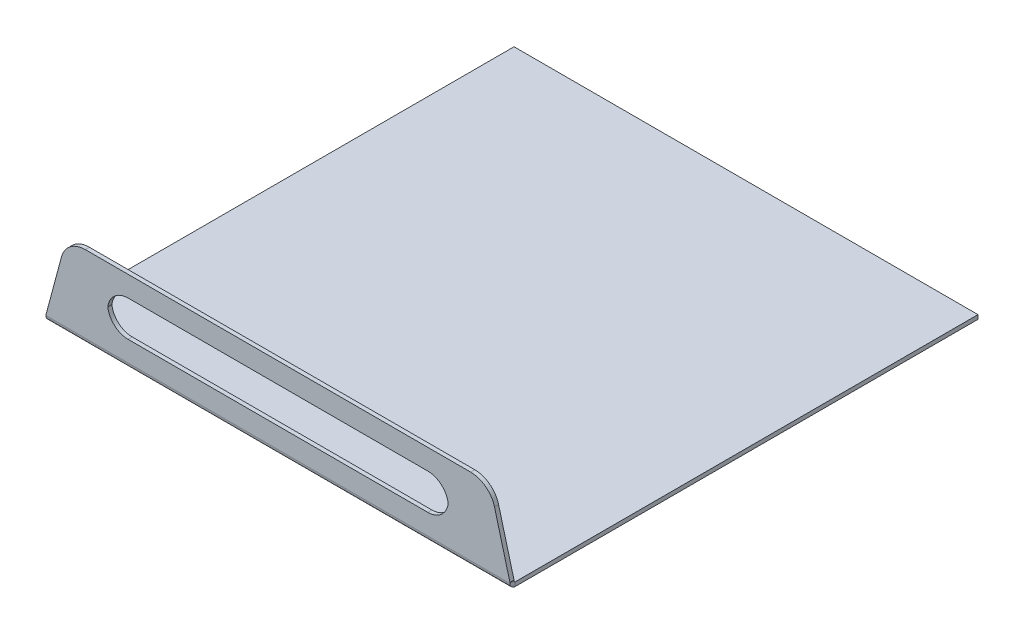
ISO-10303-21;
HEADER;
FILE_DESCRIPTION(('STEP AP214'),'2;1');
FILE_NAME('part.step','',(''),(''),'','','');
FILE_SCHEMA(('AUTOMOTIVE_DESIGN { 1 0 10303 214 1 1 1 1 }'));
ENDSEC;
DATA;
#1=APPLICATION_CONTEXT('core data for automotive mechanical design processes');
#2=APPLICATION_PROTOCOL_DEFINITION('international standard','automotive_design',2000,#1);
#3=PRODUCT_CONTEXT('',#1,'mechanical');
#4=PRODUCT('Part','Part','',(#3));
#5=PRODUCT_RELATED_PRODUCT_CATEGORY('part','',(#4));
#6=PRODUCT_DEFINITION_FORMATION('','',#4);
#7=PRODUCT_DEFINITION_CONTEXT('part definition',#1,'design');
#8=PRODUCT_DEFINITION('design','',#6,#7);
#9=PRODUCT_DEFINITION_SHAPE('','',#8);
#10=(LENGTH_UNIT() NAMED_UNIT(*) SI_UNIT(.MILLI.,.METRE.));
#11=(NAMED_UNIT(*) PLANE_ANGLE_UNIT() SI_UNIT($,.RADIAN.));
#12=(NAMED_UNIT(*) SI_UNIT($,.STERADIAN.) SOLID_ANGLE_UNIT());
#13=UNCERTAINTY_MEASURE_WITH_UNIT(LENGTH_MEASURE(1.E-05),#10,'distance_accuracy_value','');
#14=(GEOMETRIC_REPRESENTATION_CONTEXT(3) GLOBAL_UNCERTAINTY_ASSIGNED_CONTEXT((#13)) GLOBAL_UNIT_ASSIGNED_CONTEXT((#10,
#11,#12)) REPRESENTATION_CONTEXT('',''));
#15=CARTESIAN_POINT('',(0.,0.,0.));
#16=DIRECTION('',(0.,0.,1.));
#17=DIRECTION('',(1.,0.,0.));
#18=AXIS2_PLACEMENT_3D('',#15,#16,#17);
#19=CARTESIAN_POINT('',(143.51,-2.54,143.51));
#20=DIRECTION('',(1.,0.,0.));
#21=DIRECTION('',(0.,0.,-1.));
#22=AXIS2_PLACEMENT_3D('',#19,#20,#21);
#23=PLANE('',#22);
#24=DIRECTION('',(0.,0.,-1.));
#25=VECTOR('',#24,1.);
#26=CARTESIAN_POINT('',(143.51,0.,143.51));
#27=LINE('',#26,#25);
#28=CARTESIAN_POINT('',(143.51,0.,142.7734));
#29=VERTEX_POINT('',#28);
#30=CARTESIAN_POINT('',(143.51,0.,-143.51));
#31=VERTEX_POINT('',#30);
#32=EDGE_CURVE('E224',#29,#31,#27,.T.);
#33=ORIENTED_EDGE('',*,*,#32,.F.);
#34=DIRECTION('',(0.,-1.,0.));
#35=VECTOR('',#34,1.);
#36=CARTESIAN_POINT('',(143.51,0.,142.7734));
#37=LINE('',#36,#35);
#38=CARTESIAN_POINT('',(143.51,-2.54,142.7734));
#39=VERTEX_POINT('',#38);
#40=EDGE_CURVE('E214',#29,#39,#37,.T.);
#41=ORIENTED_EDGE('',*,*,#40,.T.);
#42=DIRECTION('',(0.,0.,-1.));
#43=VECTOR('',#42,1.);
#44=CARTESIAN_POINT('',(143.51,-2.54,143.51));
#45=LINE('',#44,#43);
#46=CARTESIAN_POINT('',(143.51,-2.54,-143.51));
#47=VERTEX_POINT('',#46);
#48=EDGE_CURVE('E226',#39,#47,#45,.T.);
#49=ORIENTED_EDGE('',*,*,#48,.T.);
#50=DIRECTION('',(0.,1.,0.));
#51=VECTOR('',#50,1.);
#52=CARTESIAN_POINT('',(143.51,-2.54,-143.51));
#53=LINE('',#52,#51);
#54=EDGE_CURVE('E235',#47,#31,#53,.T.);
#55=ORIENTED_EDGE('',*,*,#54,.T.);
#56=EDGE_LOOP('',(#33,#41,#49,#55));
#57=FACE_BOUND('',#56,.T.);
#58=ADVANCED_FACE('F38',(#57),#23,.T.);
#59=CARTESIAN_POINT('',(0.,-2.54,0.));
#60=DIRECTION('',(0.,-1.,0.));
#61=DIRECTION('',(0.,0.,-1.));
#62=AXIS2_PLACEMENT_3D('',#59,#60,#61);
#63=PLANE('',#62);
#64=ORIENTED_EDGE('',*,*,#48,.F.);
#65=DIRECTION('',(1.,0.,0.));
#66=VECTOR('',#65,1.);
#67=CARTESIAN_POINT('',(143.51,-2.54,142.7734));
#68=LINE('',#67,#66);
#69=CARTESIAN_POINT('',(-143.51,-2.54,142.7734));
#70=VERTEX_POINT('',#69);
#71=EDGE_CURVE('E170',#39,#70,#68,.F.);
#72=ORIENTED_EDGE('',*,*,#71,.T.);
#73=DIRECTION('',(0.,0.,1.));
#74=VECTOR('',#73,1.);
#75=CARTESIAN_POINT('',(-143.51,-2.54,143.51));
#76=LINE('',#75,#74);
#77=CARTESIAN_POINT('',(-143.51,-2.54,-143.51));
#78=VERTEX_POINT('',#77);
#79=EDGE_CURVE('E232',#78,#70,#76,.T.);
#80=ORIENTED_EDGE('',*,*,#79,.F.);
#81=DIRECTION('',(-1.,0.,0.));
#82=VECTOR('',#81,1.);
#83=CARTESIAN_POINT('',(-143.51,-2.54,-143.51));
#84=LINE('',#83,#82);
#85=EDGE_CURVE('E228',#47,#78,#84,.T.);
#86=ORIENTED_EDGE('',*,*,#85,.F.);
#87=EDGE_LOOP('',(#64,#72,#80,#86));
#88=FACE_BOUND('',#87,.T.);
#89=ADVANCED_FACE('F374',(#88),#63,.T.);
#90=CARTESIAN_POINT('',(0.,0.,0.));
#91=DIRECTION('',(0.,-1.,0.));
#92=DIRECTION('',(0.,0.,-1.));
#93=AXIS2_PLACEMENT_3D('',#90,#91,#92);
#94=PLANE('',#93);
#95=DIRECTION('',(1.,0.,0.));
#96=VECTOR('',#95,1.);
#97=CARTESIAN_POINT('',(143.51,0.,142.7734));
#98=LINE('',#97,#96);
#99=CARTESIAN_POINT('',(-143.51,0.,142.7734));
#100=VERTEX_POINT('',#99);
#101=EDGE_CURVE('E218',#29,#100,#98,.F.);
#102=ORIENTED_EDGE('',*,*,#101,.F.);
#103=ORIENTED_EDGE('',*,*,#32,.T.);
#104=DIRECTION('',(-1.,0.,0.));
#105=VECTOR('',#104,1.);
#106=CARTESIAN_POINT('',(-143.51,0.,-143.51));
#107=LINE('',#106,#105);
#108=CARTESIAN_POINT('',(-143.51,0.,-143.51));
#109=VERTEX_POINT('',#108);
#110=EDGE_CURVE('E237',#31,#109,#107,.T.);
#111=ORIENTED_EDGE('',*,*,#110,.T.);
#112=DIRECTION('',(0.,0.,1.));
#113=VECTOR('',#112,1.);
#114=CARTESIAN_POINT('',(-143.51,0.,143.51));
#115=LINE('',#114,#113);
#116=EDGE_CURVE('E229',#109,#100,#115,.T.);
#117=ORIENTED_EDGE('',*,*,#116,.T.);
#118=EDGE_LOOP('',(#102,#103,#111,#117));
#119=FACE_BOUND('',#118,.T.);
#120=ADVANCED_FACE('F380',(#119),#94,.F.);
#121=CARTESIAN_POINT('',(-143.51,-2.54,143.51));
#122=DIRECTION('',(-1.,0.,0.));
#123=DIRECTION('',(0.,0.,1.));
#124=AXIS2_PLACEMENT_3D('',#121,#122,#123);
#125=PLANE('',#124);
#126=DIRECTION('',(0.,-1.,0.));
#127=VECTOR('',#126,1.);
#128=CARTESIAN_POINT('',(-143.51,0.,142.7734));
#129=LINE('',#128,#127);
#130=EDGE_CURVE('E221',#100,#70,#129,.T.);
#131=ORIENTED_EDGE('',*,*,#130,.F.);
#132=ORIENTED_EDGE('',*,*,#116,.F.);
#133=DIRECTION('',(0.,1.,0.));
#134=VECTOR('',#133,1.);
#135=CARTESIAN_POINT('',(-143.51,-2.54,-143.51));
#136=LINE('',#135,#134);
#137=EDGE_CURVE('E242',#78,#109,#136,.T.);
#138=ORIENTED_EDGE('',*,*,#137,.F.);
#139=ORIENTED_EDGE('',*,*,#79,.T.);
#140=EDGE_LOOP('',(#131,#132,#138,#139));
#141=FACE_BOUND('',#140,.T.);
#142=ADVANCED_FACE('F537',(#141),#125,.T.);
#143=CARTESIAN_POINT('',(-143.51,-2.54,-143.51));
#144=DIRECTION('',(0.,0.,-1.));
#145=DIRECTION('',(-1.,0.,0.));
#146=AXIS2_PLACEMENT_3D('',#143,#144,#145);
#147=PLANE('',#146);
#148=ORIENTED_EDGE('',*,*,#110,.F.);
#149=ORIENTED_EDGE('',*,*,#54,.F.);
#150=ORIENTED_EDGE('',*,*,#85,.T.);
#151=ORIENTED_EDGE('',*,*,#137,.T.);
#152=EDGE_LOOP('',(#148,#149,#150,#151));
#153=FACE_BOUND('',#152,.T.);
#154=ADVANCED_FACE('F386',(#153),#147,.T.);
#155=CARTESIAN_POINT('',(-143.51,0.736600000000004,142.7734));
#156=DIRECTION('',(-1.,0.,0.));
#157=DIRECTION('',(0.,0.,1.));
#158=AXIS2_PLACEMENT_3D('',#155,#156,#157);
#159=PLANE('',#158);
#160=DIRECTION('',(0.,0.,1.));
#161=VECTOR('',#160,1.);
#162=CARTESIAN_POINT('',(-143.51,0.736600000000004,143.51));
#163=LINE('',#162,#161);
#164=CARTESIAN_POINT('',(-143.51,0.736600000000004,143.51));
#165=VERTEX_POINT('',#164);
#166=CARTESIAN_POINT('',(-143.51,0.736600000000004,146.05));
#167=VERTEX_POINT('',#166);
#168=EDGE_CURVE('E320',#165,#167,#163,.T.);
#169=ORIENTED_EDGE('',*,*,#168,.F.);
#170=CARTESIAN_POINT('',(-143.51,0.736600000000004,142.7734));
#171=DIRECTION('',(1.,0.,0.));
#172=DIRECTION('',(0.,0.,-1.));
#173=AXIS2_PLACEMENT_3D('',#170,#171,#172);
#174=CIRCLE('',#173,0.736600000000004);
#175=EDGE_CURVE('E173',#100,#165,#174,.F.);
#176=ORIENTED_EDGE('',*,*,#175,.F.);
#177=ORIENTED_EDGE('',*,*,#130,.T.);
#178=CARTESIAN_POINT('',(-143.51,0.736600000000004,142.7734));
#179=DIRECTION('',(1.,0.,0.));
#180=DIRECTION('',(0.,0.,-1.));
#181=AXIS2_PLACEMENT_3D('',#178,#179,#180);
#182=CIRCLE('',#181,3.2766);
#183=EDGE_CURVE('E213',#70,#167,#182,.F.);
#184=ORIENTED_EDGE('',*,*,#183,.T.);
#185=EDGE_LOOP('',(#169,#176,#177,#184));
#186=FACE_BOUND('',#185,.T.);
#187=ADVANCED_FACE('F519',(#186),#159,.T.);
#188=CARTESIAN_POINT('',(143.51,0.736600000000004,142.7734));
#189=DIRECTION('',(-1.,0.,0.));
#190=DIRECTION('',(0.,0.,1.));
#191=AXIS2_PLACEMENT_3D('',#188,#189,#190);
#192=PLANE('',#191);
#193=CARTESIAN_POINT('',(143.51,0.736600000000004,142.7734));
#194=DIRECTION('',(1.,0.,0.));
#195=DIRECTION('',(0.,0.,-1.));
#196=AXIS2_PLACEMENT_3D('',#193,#194,#195);
#197=CIRCLE('',#196,0.736600000000004);
#198=CARTESIAN_POINT('',(143.51,0.736600000000004,143.51));
#199=VERTEX_POINT('',#198);
#200=EDGE_CURVE('E180',#199,#29,#197,.T.);
#201=ORIENTED_EDGE('',*,*,#200,.F.);
#202=DIRECTION('',(0.,0.,1.));
#203=VECTOR('',#202,1.);
#204=CARTESIAN_POINT('',(143.51,0.736600000000004,143.51));
#205=LINE('',#204,#203);
#206=CARTESIAN_POINT('',(143.51,0.736600000000004,146.05));
#207=VERTEX_POINT('',#206);
#208=EDGE_CURVE('E177',#199,#207,#205,.T.);
#209=ORIENTED_EDGE('',*,*,#208,.T.);
#210=CARTESIAN_POINT('',(143.51,0.736600000000004,142.7734));
#211=DIRECTION('',(1.,0.,0.));
#212=DIRECTION('',(0.,0.,-1.));
#213=AXIS2_PLACEMENT_3D('',#210,#211,#212);
#214=CIRCLE('',#213,3.2766);
#215=EDGE_CURVE('E163',#207,#39,#214,.T.);
#216=ORIENTED_EDGE('',*,*,#215,.T.);
#217=ORIENTED_EDGE('',*,*,#40,.F.);
#218=EDGE_LOOP('',(#201,#209,#216,#217));
#219=FACE_BOUND('',#218,.T.);
#220=ADVANCED_FACE('F178',(#219),#192,.F.);
#221=CARTESIAN_POINT('',(143.51,0.736600000000004,142.7734));
#222=DIRECTION('',(1.,0.,0.));
#223=DIRECTION('',(0.,0.,1.));
#224=AXIS2_PLACEMENT_3D('',#221,#222,#223);
#225=CYLINDRICAL_SURFACE('',#224,3.2766);
#226=ORIENTED_EDGE('',*,*,#71,.F.);
#227=ORIENTED_EDGE('',*,*,#215,.F.);
#228=DIRECTION('',(-1.,0.,0.));
#229=VECTOR('',#228,1.);
#230=CARTESIAN_POINT('',(0.,0.736600000000004,146.05));
#231=LINE('',#230,#229);
#232=EDGE_CURVE('E167',#207,#167,#231,.T.);
#233=ORIENTED_EDGE('',*,*,#232,.T.);
#234=ORIENTED_EDGE('',*,*,#183,.F.);
#235=EDGE_LOOP('',(#226,#227,#233,#234));
#236=FACE_BOUND('',#235,.T.);
#237=ADVANCED_FACE('F165',(#236),#225,.T.);
#238=CARTESIAN_POINT('',(143.51,0.736600000000004,142.7734));
#239=DIRECTION('',(1.,0.,0.));
#240=DIRECTION('',(0.,0.,1.));
#241=AXIS2_PLACEMENT_3D('',#238,#239,#240);
#242=CYLINDRICAL_SURFACE('',#241,0.736600000000004);
#243=ORIENTED_EDGE('',*,*,#101,.T.);
#244=ORIENTED_EDGE('',*,*,#175,.T.);
#245=DIRECTION('',(1.,0.,0.));
#246=VECTOR('',#245,1.);
#247=CARTESIAN_POINT('',(-143.51,0.736600000000004,143.51));
#248=LINE('',#247,#246);
#249=EDGE_CURVE('E185',#165,#199,#248,.T.);
#250=ORIENTED_EDGE('',*,*,#249,.T.);
#251=ORIENTED_EDGE('',*,*,#200,.T.);
#252=EDGE_LOOP('',(#243,#244,#250,#251));
#253=FACE_BOUND('',#252,.T.);
#254=ADVANCED_FACE('F491',(#253),#242,.F.);
#255=CARTESIAN_POINT('',(-143.51,0.,146.05));
#256=DIRECTION('',(1.,0.,0.));
#257=DIRECTION('',(0.,0.,-1.));
#258=AXIS2_PLACEMENT_3D('',#255,#256,#257);
#259=PLANE('',#258);
#260=DIRECTION('',(0.,-1.,0.));
#261=VECTOR('',#260,1.);
#262=CARTESIAN_POINT('',(-143.51,0.,146.05));
#263=LINE('',#262,#261);
#264=CARTESIAN_POINT('',(-143.51,1.26999999999941,146.05));
#265=VERTEX_POINT('',#264);
#266=EDGE_CURVE('E195',#265,#167,#263,.T.);
#267=ORIENTED_EDGE('',*,*,#266,.F.);
#268=DIRECTION('',(0.,0.,-1.));
#269=VECTOR('',#268,1.);
#270=CARTESIAN_POINT('',(-143.51,1.26999999999942,146.05));
#271=LINE('',#270,#269);
#272=CARTESIAN_POINT('',(-143.51,1.26999999999928,143.51));
#273=VERTEX_POINT('',#272);
#274=EDGE_CURVE('E255',#265,#273,#271,.T.);
#275=ORIENTED_EDGE('',*,*,#274,.T.);
#276=DIRECTION('',(0.,-1.,0.));
#277=VECTOR('',#276,1.);
#278=CARTESIAN_POINT('',(-143.51,0.,143.51));
#279=LINE('',#278,#277);
#280=EDGE_CURVE('E196',#273,#165,#279,.T.);
#281=ORIENTED_EDGE('',*,*,#280,.T.);
#282=ORIENTED_EDGE('',*,*,#168,.T.);
#283=EDGE_LOOP('',(#267,#275,#281,#282));
#284=FACE_BOUND('',#283,.T.);
#285=ADVANCED_FACE('F315',(#284),#259,.F.);
#286=CARTESIAN_POINT('',(143.51,48.26,146.05));
#287=DIRECTION('',(-1.,0.,0.));
#288=DIRECTION('',(0.,0.,1.));
#289=AXIS2_PLACEMENT_3D('',#286,#287,#288);
#290=PLANE('',#289);
#291=DIRECTION('',(0.,1.,0.));
#292=VECTOR('',#291,1.);
#293=CARTESIAN_POINT('',(143.51,48.26,143.51));
#294=LINE('',#293,#292);
#295=CARTESIAN_POINT('',(143.51,1.26999999999941,143.51));
#296=VERTEX_POINT('',#295);
#297=EDGE_CURVE('E208',#199,#296,#294,.T.);
#298=ORIENTED_EDGE('',*,*,#297,.T.);
#299=DIRECTION('',(0.,0.,1.));
#300=VECTOR('',#299,1.);
#301=CARTESIAN_POINT('',(143.51,1.26999999999941,146.05));
#302=LINE('',#301,#300);
#303=CARTESIAN_POINT('',(143.51,1.2699999999994,146.05));
#304=VERTEX_POINT('',#303);
#305=EDGE_CURVE('E200',#296,#304,#302,.T.);
#306=ORIENTED_EDGE('',*,*,#305,.T.);
#307=DIRECTION('',(0.,1.,0.));
#308=VECTOR('',#307,1.);
#309=CARTESIAN_POINT('',(143.51,48.26,146.05));
#310=LINE('',#309,#308);
#311=EDGE_CURVE('E192',#207,#304,#310,.T.);
#312=ORIENTED_EDGE('',*,*,#311,.F.);
#313=ORIENTED_EDGE('',*,*,#208,.F.);
#314=EDGE_LOOP('',(#298,#306,#312,#313));
#315=FACE_BOUND('',#314,.T.);
#316=ADVANCED_FACE('F198',(#315),#290,.F.);
#317=CARTESIAN_POINT('',(0.,0.,146.05));
#318=DIRECTION('',(0.,0.,-1.));
#319=DIRECTION('',(-1.,0.,0.));
#320=AXIS2_PLACEMENT_3D('',#317,#318,#319);
#321=PLANE('',#320);
#322=CARTESIAN_POINT('',(-92.71,26.1366,146.05));
#323=DIRECTION('',(0.,0.,-1.));
#324=DIRECTION('',(-1.,0.,0.));
#325=AXIS2_PLACEMENT_3D('',#322,#323,#324);
#326=CIRCLE('',#325,12.7);
#327=CARTESIAN_POINT('',(-92.71,13.4366,146.05));
#328=VERTEX_POINT('',#327);
#329=CARTESIAN_POINT('',(-105.303886338617,24.4983,146.05));
#330=VERTEX_POINT('',#329);
#331=EDGE_CURVE('E276',#328,#330,#326,.T.);
#332=ORIENTED_EDGE('',*,*,#331,.T.);
#333=CARTESIAN_POINT('',(-92.71,22.86,146.05));
#334=DIRECTION('',(0.,0.,-1.));
#335=DIRECTION('',(-1.,0.,0.));
#336=AXIS2_PLACEMENT_3D('',#333,#334,#335);
#337=CIRCLE('',#336,12.7);
#338=CARTESIAN_POINT('',(-92.71,35.56,146.05));
#339=VERTEX_POINT('',#338);
#340=EDGE_CURVE('E280',#330,#339,#337,.T.);
#341=ORIENTED_EDGE('',*,*,#340,.T.);
#342=DIRECTION('',(-1.,0.,0.));
#343=VECTOR('',#342,1.);
#344=CARTESIAN_POINT('',(-105.41,35.56,146.05));
#345=LINE('',#344,#343);
#346=CARTESIAN_POINT('',(92.71,35.56,146.05));
#347=VERTEX_POINT('',#346);
#348=EDGE_CURVE('E325',#347,#339,#345,.T.);
#349=ORIENTED_EDGE('',*,*,#348,.F.);
#350=CARTESIAN_POINT('',(92.71,22.86,146.05));
#351=DIRECTION('',(0.,0.,-1.));
#352=DIRECTION('',(-1.,0.,0.));
#353=AXIS2_PLACEMENT_3D('',#350,#351,#352);
#354=CIRCLE('',#353,12.7);
#355=CARTESIAN_POINT('',(105.303886338617,24.4983,146.05));
#356=VERTEX_POINT('',#355);
#357=EDGE_CURVE('E272',#347,#356,#354,.T.);
#358=ORIENTED_EDGE('',*,*,#357,.T.);
#359=CARTESIAN_POINT('',(92.71,26.1366,146.05));
#360=DIRECTION('',(0.,0.,-1.));
#361=DIRECTION('',(-1.,0.,0.));
#362=AXIS2_PLACEMENT_3D('',#359,#360,#361);
#363=CIRCLE('',#362,12.7);
#364=CARTESIAN_POINT('',(92.71,13.4366,146.05));
#365=VERTEX_POINT('',#364);
#366=EDGE_CURVE('E268',#356,#365,#363,.T.);
#367=ORIENTED_EDGE('',*,*,#366,.T.);
#368=DIRECTION('',(1.,0.,0.));
#369=VECTOR('',#368,1.);
#370=CARTESIAN_POINT('',(-105.41,13.4366,146.05));
#371=LINE('',#370,#369);
#372=EDGE_CURVE('E288',#328,#365,#371,.T.);
#373=ORIENTED_EDGE('',*,*,#372,.F.);
#374=EDGE_LOOP('',(#332,#341,#349,#358,#367,#373));
#375=FACE_BOUND('',#374,.T.);
#376=DIRECTION('',(-1.,0.,0.));
#377=VECTOR('',#376,1.);
#378=CARTESIAN_POINT('',(-143.51,48.26,146.05));
#379=LINE('',#378,#377);
#380=CARTESIAN_POINT('',(119.225004150862,48.26,146.05));
#381=VERTEX_POINT('',#380);
#382=CARTESIAN_POINT('',(-119.225004150862,48.26,146.05));
#383=VERTEX_POINT('',#382);
#384=EDGE_CURVE('E201',#381,#383,#379,.T.);
#385=ORIENTED_EDGE('',*,*,#384,.T.);
#386=CARTESIAN_POINT('',(-119.225004150862,33.02,146.05));
#387=DIRECTION('',(0.,0.,-1.));
#388=DIRECTION('',(-1.,0.,0.));
#389=AXIS2_PLACEMENT_3D('',#386,#387,#388);
#390=CIRCLE('',#389,15.24);
#391=CARTESIAN_POINT('',(-133.945713743508,36.9644022473624,146.05));
#392=VERTEX_POINT('',#391);
#393=EDGE_CURVE('E299',#383,#392,#390,.F.);
#394=ORIENTED_EDGE('',*,*,#393,.T.);
#395=DIRECTION('',(0.258819045102518,0.965925826289069,0.));
#396=VECTOR('',#395,1.);
#397=CARTESIAN_POINT('',(-143.51,1.26999999999942,146.05));
#398=LINE('',#397,#396);
#399=EDGE_CURVE('E251',#392,#265,#398,.F.);
#400=ORIENTED_EDGE('',*,*,#399,.T.);
#401=ORIENTED_EDGE('',*,*,#266,.T.);
#402=ORIENTED_EDGE('',*,*,#232,.F.);
#403=ORIENTED_EDGE('',*,*,#311,.T.);
#404=DIRECTION('',(0.258819045102519,-0.965925826289069,0.));
#405=VECTOR('',#404,1.);
#406=CARTESIAN_POINT('',(130.919067447661,48.26,146.05));
#407=LINE('',#406,#405);
#408=CARTESIAN_POINT('',(133.945713743508,36.9644022473624,146.05));
#409=VERTEX_POINT('',#408);
#410=EDGE_CURVE('E253',#304,#409,#407,.F.);
#411=ORIENTED_EDGE('',*,*,#410,.T.);
#412=CARTESIAN_POINT('',(119.225004150862,33.02,146.05));
#413=DIRECTION('',(0.,0.,-1.));
#414=DIRECTION('',(-1.,0.,0.));
#415=AXIS2_PLACEMENT_3D('',#412,#413,#414);
#416=CIRCLE('',#415,15.24);
#417=EDGE_CURVE('E297',#409,#381,#416,.F.);
#418=ORIENTED_EDGE('',*,*,#417,.T.);
#419=EDGE_LOOP('',(#385,#394,#400,#401,#402,#403,#411,#418));
#420=FACE_BOUND('',#419,.T.);
#421=ADVANCED_FACE('F190',(#375,#420),#321,.F.);
#422=CARTESIAN_POINT('',(0.,0.,143.51));
#423=DIRECTION('',(0.,0.,-1.));
#424=DIRECTION('',(-1.,0.,0.));
#425=AXIS2_PLACEMENT_3D('',#422,#423,#424);
#426=PLANE('',#425);
#427=DIRECTION('',(-1.,0.,0.));
#428=VECTOR('',#427,1.);
#429=CARTESIAN_POINT('',(-105.41,35.56,143.51));
#430=LINE('',#429,#428);
#431=CARTESIAN_POINT('',(92.71,35.56,143.51));
#432=VERTEX_POINT('',#431);
#433=CARTESIAN_POINT('',(-92.71,35.56,143.51));
#434=VERTEX_POINT('',#433);
#435=EDGE_CURVE('E322',#432,#434,#430,.T.);
#436=ORIENTED_EDGE('',*,*,#435,.T.);
#437=CARTESIAN_POINT('',(-92.71,22.86,143.51));
#438=DIRECTION('',(0.,0.,-1.));
#439=DIRECTION('',(-1.,0.,0.));
#440=AXIS2_PLACEMENT_3D('',#437,#438,#439);
#441=CIRCLE('',#440,12.7);
#442=CARTESIAN_POINT('',(-105.303886338617,24.4983,143.51));
#443=VERTEX_POINT('',#442);
#444=EDGE_CURVE('E282',#434,#443,#441,.F.);
#445=ORIENTED_EDGE('',*,*,#444,.T.);
#446=CARTESIAN_POINT('',(-92.71,26.1366,143.51));
#447=DIRECTION('',(0.,0.,-1.));
#448=DIRECTION('',(-1.,0.,0.));
#449=AXIS2_PLACEMENT_3D('',#446,#447,#448);
#450=CIRCLE('',#449,12.7);
#451=CARTESIAN_POINT('',(-92.71,13.4366,143.51));
#452=VERTEX_POINT('',#451);
#453=EDGE_CURVE('E278',#443,#452,#450,.F.);
#454=ORIENTED_EDGE('',*,*,#453,.T.);
#455=DIRECTION('',(1.,0.,0.));
#456=VECTOR('',#455,1.);
#457=CARTESIAN_POINT('',(-105.41,13.4366,143.51));
#458=LINE('',#457,#456);
#459=CARTESIAN_POINT('',(92.71,13.4366,143.51));
#460=VERTEX_POINT('',#459);
#461=EDGE_CURVE('E328',#452,#460,#458,.T.);
#462=ORIENTED_EDGE('',*,*,#461,.T.);
#463=CARTESIAN_POINT('',(92.71,26.1366,143.51));
#464=DIRECTION('',(0.,0.,-1.));
#465=DIRECTION('',(-1.,0.,0.));
#466=AXIS2_PLACEMENT_3D('',#463,#464,#465);
#467=CIRCLE('',#466,12.7);
#468=CARTESIAN_POINT('',(105.303886338617,24.4983,143.51));
#469=VERTEX_POINT('',#468);
#470=EDGE_CURVE('E270',#460,#469,#467,.F.);
#471=ORIENTED_EDGE('',*,*,#470,.T.);
#472=CARTESIAN_POINT('',(92.71,22.86,143.51));
#473=DIRECTION('',(0.,0.,-1.));
#474=DIRECTION('',(-1.,0.,0.));
#475=AXIS2_PLACEMENT_3D('',#472,#473,#474);
#476=CIRCLE('',#475,12.7);
#477=EDGE_CURVE('E274',#469,#432,#476,.F.);
#478=ORIENTED_EDGE('',*,*,#477,.T.);
#479=EDGE_LOOP('',(#436,#445,#454,#462,#471,#478));
#480=FACE_BOUND('',#479,.T.);
#481=DIRECTION('',(-0.258819045102518,-0.965925826289069,0.));
#482=VECTOR('',#481,1.);
#483=CARTESIAN_POINT('',(-134.214152848552,35.9625738685965,143.51));
#484=LINE('',#483,#482);
#485=CARTESIAN_POINT('',(-133.945713743508,36.9644022473624,143.51));
#486=VERTEX_POINT('',#485);
#487=EDGE_CURVE('E244',#273,#486,#484,.F.);
#488=ORIENTED_EDGE('',*,*,#487,.T.);
#489=CARTESIAN_POINT('',(-119.225004150862,33.02,143.51));
#490=DIRECTION('',(0.,0.,-1.));
#491=DIRECTION('',(-1.,0.,0.));
#492=AXIS2_PLACEMENT_3D('',#489,#490,#491);
#493=CIRCLE('',#492,15.24);
#494=CARTESIAN_POINT('',(-119.225004150862,48.26,143.51));
#495=VERTEX_POINT('',#494);
#496=EDGE_CURVE('E46',#486,#495,#493,.T.);
#497=ORIENTED_EDGE('',*,*,#496,.T.);
#498=DIRECTION('',(-1.,0.,0.));
#499=VECTOR('',#498,1.);
#500=CARTESIAN_POINT('',(-143.51,48.26,143.51));
#501=LINE('',#500,#499);
#502=CARTESIAN_POINT('',(119.225004150862,48.26,143.51));
#503=VERTEX_POINT('',#502);
#504=EDGE_CURVE('E204',#503,#495,#501,.T.);
#505=ORIENTED_EDGE('',*,*,#504,.F.);
#506=CARTESIAN_POINT('',(119.225004150862,33.02,143.51));
#507=DIRECTION('',(0.,0.,-1.));
#508=DIRECTION('',(-1.,0.,0.));
#509=AXIS2_PLACEMENT_3D('',#506,#507,#508);
#510=CIRCLE('',#509,15.24);
#511=CARTESIAN_POINT('',(133.945713743508,36.9644022473624,143.51));
#512=VERTEX_POINT('',#511);
#513=EDGE_CURVE('E53',#503,#512,#510,.T.);
#514=ORIENTED_EDGE('',*,*,#513,.T.);
#515=DIRECTION('',(-0.258819045102519,0.965925826289069,0.));
#516=VECTOR('',#515,1.);
#517=CARTESIAN_POINT('',(134.214152848552,35.9625738685966,143.51));
#518=LINE('',#517,#516);
#519=EDGE_CURVE('E248',#512,#296,#518,.F.);
#520=ORIENTED_EDGE('',*,*,#519,.T.);
#521=ORIENTED_EDGE('',*,*,#297,.F.);
#522=ORIENTED_EDGE('',*,*,#249,.F.);
#523=ORIENTED_EDGE('',*,*,#280,.F.);
#524=EDGE_LOOP('',(#488,#497,#505,#514,#520,#521,#522,#523));
#525=FACE_BOUND('',#524,.T.);
#526=ADVANCED_FACE('F303',(#480,#525),#426,.T.);
#527=CARTESIAN_POINT('',(-143.51,48.26,146.05));
#528=DIRECTION('',(0.,-1.,0.));
#529=DIRECTION('',(0.,0.,-1.));
#530=AXIS2_PLACEMENT_3D('',#527,#528,#529);
#531=PLANE('',#530);
#532=ORIENTED_EDGE('',*,*,#504,.T.);
#533=DIRECTION('',(0.,0.,-1.));
#534=VECTOR('',#533,1.);
#535=CARTESIAN_POINT('',(-119.225004150862,48.26,146.05));
#536=LINE('',#535,#534);
#537=EDGE_CURVE('E294',#495,#383,#536,.F.);
#538=ORIENTED_EDGE('',*,*,#537,.T.);
#539=ORIENTED_EDGE('',*,*,#384,.F.);
#540=DIRECTION('',(0.,0.,1.));
#541=VECTOR('',#540,1.);
#542=CARTESIAN_POINT('',(119.225004150862,48.26,143.51));
#543=LINE('',#542,#541);
#544=EDGE_CURVE('E284',#381,#503,#543,.F.);
#545=ORIENTED_EDGE('',*,*,#544,.T.);
#546=EDGE_LOOP('',(#532,#538,#539,#545));
#547=FACE_BOUND('',#546,.T.);
#548=ADVANCED_FACE('F308',(#547),#531,.F.);
#549=CARTESIAN_POINT('',(-105.41,35.56,143.51));
#550=DIRECTION('',(0.,1.,0.));
#551=DIRECTION('',(0.,0.,1.));
#552=AXIS2_PLACEMENT_3D('',#549,#550,#551);
#553=PLANE('',#552);
#554=ORIENTED_EDGE('',*,*,#435,.F.);
#555=DIRECTION('',(0.,0.,1.));
#556=VECTOR('',#555,1.);
#557=CARTESIAN_POINT('',(92.71,35.56,146.05));
#558=LINE('',#557,#556);
#559=EDGE_CURVE('E266',#432,#347,#558,.T.);
#560=ORIENTED_EDGE('',*,*,#559,.T.);
#561=ORIENTED_EDGE('',*,*,#348,.T.);
#562=DIRECTION('',(0.,0.,1.));
#563=VECTOR('',#562,1.);
#564=CARTESIAN_POINT('',(-92.71,35.56,143.51));
#565=LINE('',#564,#563);
#566=EDGE_CURVE('E264',#339,#434,#565,.F.);
#567=ORIENTED_EDGE('',*,*,#566,.T.);
#568=EDGE_LOOP('',(#554,#560,#561,#567));
#569=FACE_BOUND('',#568,.T.);
#570=ADVANCED_FACE('F355',(#569),#553,.F.);
#571=CARTESIAN_POINT('',(-105.41,13.4366,143.51));
#572=DIRECTION('',(0.,-1.,0.));
#573=DIRECTION('',(0.,0.,-1.));
#574=AXIS2_PLACEMENT_3D('',#571,#572,#573);
#575=PLANE('',#574);
#576=ORIENTED_EDGE('',*,*,#372,.T.);
#577=DIRECTION('',(0.,0.,1.));
#578=VECTOR('',#577,1.);
#579=CARTESIAN_POINT('',(92.71,13.4366,143.51));
#580=LINE('',#579,#578);
#581=EDGE_CURVE('E261',#365,#460,#580,.F.);
#582=ORIENTED_EDGE('',*,*,#581,.T.);
#583=ORIENTED_EDGE('',*,*,#461,.F.);
#584=DIRECTION('',(0.,0.,1.));
#585=VECTOR('',#584,1.);
#586=CARTESIAN_POINT('',(-92.71,13.4366,146.05));
#587=LINE('',#586,#585);
#588=EDGE_CURVE('E258',#452,#328,#587,.T.);
#589=ORIENTED_EDGE('',*,*,#588,.T.);
#590=EDGE_LOOP('',(#576,#582,#583,#589));
#591=FACE_BOUND('',#590,.T.);
#592=ADVANCED_FACE('F340',(#591),#575,.F.);
#593=CARTESIAN_POINT('',(130.919067447661,48.26,146.05));
#594=DIRECTION('',(-0.965925826289069,-0.258819045102519,0.));
#595=DIRECTION('',(0.,0.,-1.));
#596=AXIS2_PLACEMENT_3D('',#593,#594,#595);
#597=PLANE('',#596);
#598=ORIENTED_EDGE('',*,*,#519,.F.);
#599=DIRECTION('',(0.,0.,-1.));
#600=VECTOR('',#599,1.);
#601=CARTESIAN_POINT('',(133.945713743508,36.9644022473624,146.05));
#602=LINE('',#601,#600);
#603=EDGE_CURVE('E11',#512,#409,#602,.F.);
#604=ORIENTED_EDGE('',*,*,#603,.T.);
#605=ORIENTED_EDGE('',*,*,#410,.F.);
#606=ORIENTED_EDGE('',*,*,#305,.F.);
#607=EDGE_LOOP('',(#598,#604,#605,#606));
#608=FACE_BOUND('',#607,.T.);
#609=ADVANCED_FACE('F388',(#608),#597,.F.);
#610=CARTESIAN_POINT('',(-143.51,1.26999999999942,146.05));
#611=DIRECTION('',(0.965925826289069,-0.258819045102518,0.));
#612=DIRECTION('',(0.,0.,-1.));
#613=AXIS2_PLACEMENT_3D('',#610,#611,#612);
#614=PLANE('',#613);
#615=ORIENTED_EDGE('',*,*,#399,.F.);
#616=DIRECTION('',(0.,0.,1.));
#617=VECTOR('',#616,1.);
#618=CARTESIAN_POINT('',(-133.945713743508,36.9644022473624,143.51));
#619=LINE('',#618,#617);
#620=EDGE_CURVE('E61',#392,#486,#619,.F.);
#621=ORIENTED_EDGE('',*,*,#620,.T.);
#622=ORIENTED_EDGE('',*,*,#487,.F.);
#623=ORIENTED_EDGE('',*,*,#274,.F.);
#624=EDGE_LOOP('',(#615,#621,#622,#623));
#625=FACE_BOUND('',#624,.T.);
#626=ADVANCED_FACE('F313',(#625),#614,.F.);
#627=CARTESIAN_POINT('',(92.71,22.86,143.51));
#628=DIRECTION('',(0.,0.,-1.));
#629=DIRECTION('',(-1.,0.,0.));
#630=AXIS2_PLACEMENT_3D('',#627,#628,#629);
#631=CYLINDRICAL_SURFACE('',#630,12.7);
#632=ORIENTED_EDGE('',*,*,#559,.F.);
#633=ORIENTED_EDGE('',*,*,#477,.F.);
#634=DIRECTION('',(0.,0.,-1.));
#635=VECTOR('',#634,1.);
#636=CARTESIAN_POINT('',(105.303886338617,24.4983,144.78));
#637=LINE('',#636,#635);
#638=EDGE_CURVE('E285',#356,#469,#637,.T.);
#639=ORIENTED_EDGE('',*,*,#638,.F.);
#640=ORIENTED_EDGE('',*,*,#357,.F.);
#641=EDGE_LOOP('',(#632,#633,#639,#640));
#642=FACE_BOUND('',#641,.T.);
#643=ADVANCED_FACE('F359',(#642),#631,.F.);
#644=CARTESIAN_POINT('',(92.71,26.1366,143.51));
#645=DIRECTION('',(0.,0.,-1.));
#646=DIRECTION('',(-1.,0.,0.));
#647=AXIS2_PLACEMENT_3D('',#644,#645,#646);
#648=CYLINDRICAL_SURFACE('',#647,12.7);
#649=ORIENTED_EDGE('',*,*,#470,.F.);
#650=ORIENTED_EDGE('',*,*,#581,.F.);
#651=ORIENTED_EDGE('',*,*,#366,.F.);
#652=ORIENTED_EDGE('',*,*,#638,.T.);
#653=EDGE_LOOP('',(#649,#650,#651,#652));
#654=FACE_BOUND('',#653,.T.);
#655=ADVANCED_FACE('F363',(#654),#648,.F.);
#656=CARTESIAN_POINT('',(-92.71,22.86,143.51));
#657=DIRECTION('',(0.,0.,-1.));
#658=DIRECTION('',(-1.,0.,0.));
#659=AXIS2_PLACEMENT_3D('',#656,#657,#658);
#660=CYLINDRICAL_SURFACE('',#659,12.7);
#661=DIRECTION('',(0.,0.,-1.));
#662=VECTOR('',#661,1.);
#663=CARTESIAN_POINT('',(-105.303886338617,24.4983,144.78));
#664=LINE('',#663,#662);
#665=EDGE_CURVE('E289',#443,#330,#664,.F.);
#666=ORIENTED_EDGE('',*,*,#665,.F.);
#667=ORIENTED_EDGE('',*,*,#444,.F.);
#668=ORIENTED_EDGE('',*,*,#566,.F.);
#669=ORIENTED_EDGE('',*,*,#340,.F.);
#670=EDGE_LOOP('',(#666,#667,#668,#669));
#671=FACE_BOUND('',#670,.T.);
#672=ADVANCED_FACE('F351',(#671),#660,.F.);
#673=CARTESIAN_POINT('',(-92.71,26.1366,143.51));
#674=DIRECTION('',(0.,0.,-1.));
#675=DIRECTION('',(-1.,0.,0.));
#676=AXIS2_PLACEMENT_3D('',#673,#674,#675);
#677=CYLINDRICAL_SURFACE('',#676,12.7);
#678=ORIENTED_EDGE('',*,*,#453,.F.);
#679=ORIENTED_EDGE('',*,*,#665,.T.);
#680=ORIENTED_EDGE('',*,*,#331,.F.);
#681=ORIENTED_EDGE('',*,*,#588,.F.);
#682=EDGE_LOOP('',(#678,#679,#680,#681));
#683=FACE_BOUND('',#682,.T.);
#684=ADVANCED_FACE('F344',(#683),#677,.F.);
#685=CARTESIAN_POINT('',(-119.225004150862,33.02,146.05));
#686=DIRECTION('',(0.,0.,1.));
#687=DIRECTION('',(1.,0.,0.));
#688=AXIS2_PLACEMENT_3D('',#685,#686,#687);
#689=CYLINDRICAL_SURFACE('',#688,15.24);
#690=ORIENTED_EDGE('',*,*,#496,.F.);
#691=ORIENTED_EDGE('',*,*,#620,.F.);
#692=ORIENTED_EDGE('',*,*,#393,.F.);
#693=ORIENTED_EDGE('',*,*,#537,.F.);
#694=EDGE_LOOP('',(#690,#691,#692,#693));
#695=FACE_BOUND('',#694,.T.);
#696=ADVANCED_FACE('F311',(#695),#689,.T.);
#697=CARTESIAN_POINT('',(119.225004150862,33.02,146.05));
#698=DIRECTION('',(0.,0.,-1.));
#699=DIRECTION('',(-1.,0.,0.));
#700=AXIS2_PLACEMENT_3D('',#697,#698,#699);
#701=CYLINDRICAL_SURFACE('',#700,15.24);
#702=ORIENTED_EDGE('',*,*,#417,.F.);
#703=ORIENTED_EDGE('',*,*,#603,.F.);
#704=ORIENTED_EDGE('',*,*,#513,.F.);
#705=ORIENTED_EDGE('',*,*,#544,.F.);
#706=EDGE_LOOP('',(#702,#703,#704,#705));
#707=FACE_BOUND('',#706,.T.);
#708=ADVANCED_FACE('F40',(#707),#701,.T.);
#709=CLOSED_SHELL('',(#58,#89,#120,#142,#154,#187,#220,#237,#254,#285,#316,#421,#526,#548,#570,
#592,#609,#626,#643,#655,#672,#684,#696,#708));
#710=MANIFOLD_SOLID_BREP('B2',#709);
#711=ADVANCED_BREP_SHAPE_REPRESENTATION('',(#18,#710),#14);
#712=SHAPE_DEFINITION_REPRESENTATION(#9,#711);
ENDSEC;
END-ISO-10303-21;
